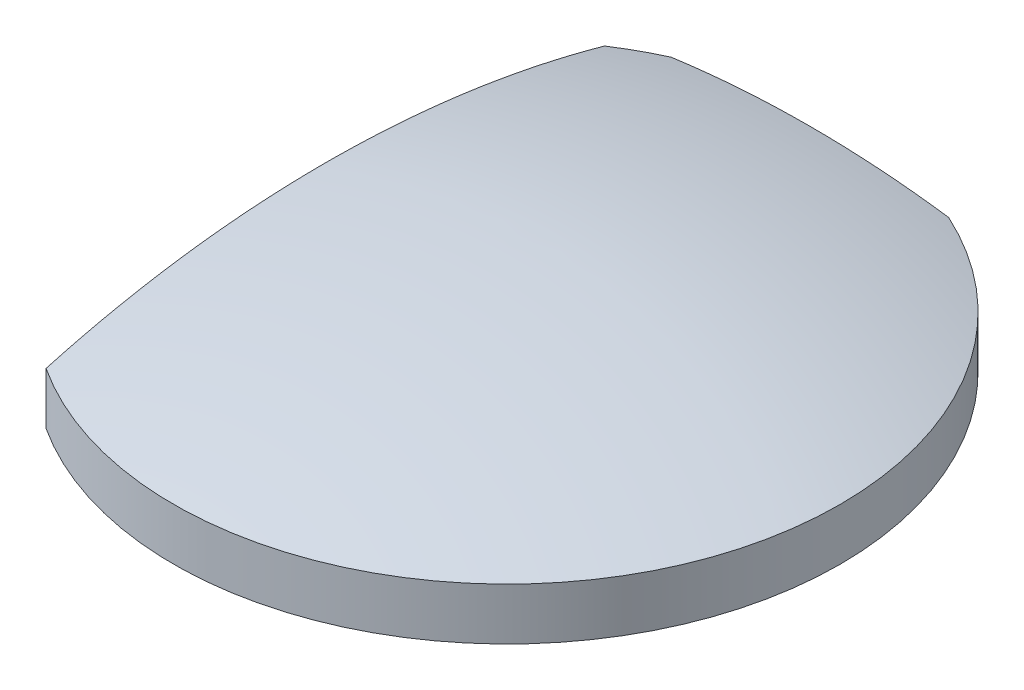
ISO-10303-21;
HEADER;
FILE_DESCRIPTION(('STEP AP214'),'2;1');
FILE_NAME('part.step','',(''),(''),'','','');
FILE_SCHEMA(('AUTOMOTIVE_DESIGN { 1 0 10303 214 1 1 1 1 }'));
ENDSEC;
DATA;
#1=APPLICATION_CONTEXT('core data for automotive mechanical design processes');
#2=APPLICATION_PROTOCOL_DEFINITION('international standard','automotive_design',2000,#1);
#3=PRODUCT_CONTEXT('',#1,'mechanical');
#4=PRODUCT('Part','Part','',(#3));
#5=PRODUCT_RELATED_PRODUCT_CATEGORY('part','',(#4));
#6=PRODUCT_DEFINITION_FORMATION('','',#4);
#7=PRODUCT_DEFINITION_CONTEXT('part definition',#1,'design');
#8=PRODUCT_DEFINITION('design','',#6,#7);
#9=PRODUCT_DEFINITION_SHAPE('','',#8);
#10=(LENGTH_UNIT() NAMED_UNIT(*) SI_UNIT(.MILLI.,.METRE.));
#11=(NAMED_UNIT(*) PLANE_ANGLE_UNIT() SI_UNIT($,.RADIAN.));
#12=(NAMED_UNIT(*) SI_UNIT($,.STERADIAN.) SOLID_ANGLE_UNIT());
#13=UNCERTAINTY_MEASURE_WITH_UNIT(LENGTH_MEASURE(1.E-05),#10,'distance_accuracy_value','');
#14=(GEOMETRIC_REPRESENTATION_CONTEXT(3) GLOBAL_UNCERTAINTY_ASSIGNED_CONTEXT((#13)) GLOBAL_UNIT_ASSIGNED_CONTEXT((#10,
#11,#12)) REPRESENTATION_CONTEXT('',''));
#15=CARTESIAN_POINT('',(0.,0.,0.));
#16=DIRECTION('',(0.,0.,1.));
#17=DIRECTION('',(1.,0.,0.));
#18=AXIS2_PLACEMENT_3D('',#15,#16,#17);
#19=CARTESIAN_POINT('',(0.,-31.25,0.));
#20=DIRECTION('',(0.,1.,0.));
#21=DIRECTION('',(0.,0.,-1.));
#22=AXIS2_PLACEMENT_3D('',#19,#20,#21);
#23=SPHERICAL_SURFACE('',#22,34.75);
#24=CARTESIAN_POINT('',(0.,-31.25,-10.));
#25=DIRECTION('',(0.,0.,-1.));
#26=DIRECTION('',(-1.,0.,0.));
#27=AXIS2_PLACEMENT_3D('',#24,#25,#26);
#28=CIRCLE('',#27,33.2800615985007);
#29=CARTESIAN_POINT('',(-4.58257569495582,1.71304749260906,-10.));
#30=VERTEX_POINT('',#29);
#31=CARTESIAN_POINT('',(4.58257569495583,1.71304749260906,-10.));
#32=VERTEX_POINT('',#31);
#33=EDGE_CURVE('E44',#30,#32,#28,.T.);
#34=ORIENTED_EDGE('',*,*,#33,.F.);
#35=CARTESIAN_POINT('',(0.,1.71304749260906,0.));
#36=DIRECTION('',(0.,1.,0.));
#37=DIRECTION('',(0.,0.,1.));
#38=AXIS2_PLACEMENT_3D('',#35,#36,#37);
#39=CIRCLE('',#38,11.);
#40=CARTESIAN_POINT('',(-6.,1.71304749260906,-9.21954445729288));
#41=VERTEX_POINT('',#40);
#42=EDGE_CURVE('E82',#30,#41,#39,.T.);
#43=ORIENTED_EDGE('',*,*,#42,.T.);
#44=CARTESIAN_POINT('',(-6.,-31.25,0.));
#45=DIRECTION('',(1.,0.,0.));
#46=DIRECTION('',(0.,0.,-1.));
#47=AXIS2_PLACEMENT_3D('',#44,#45,#46);
#48=CIRCLE('',#47,34.2280951850961);
#49=CARTESIAN_POINT('',(-6.,1.71304749260906,9.21954445729288));
#50=VERTEX_POINT('',#49);
#51=EDGE_CURVE('E97',#41,#50,#48,.T.);
#52=ORIENTED_EDGE('',*,*,#51,.T.);
#53=EDGE_CURVE('E85',#50,#32,#39,.T.);
#54=ORIENTED_EDGE('',*,*,#53,.T.);
#55=EDGE_LOOP('',(#34,#43,#52,#54));
#56=FACE_BOUND('',#55,.T.);
#57=ADVANCED_FACE('F31',(#56),#23,.T.);
#58=CARTESIAN_POINT('',(0.,0.,0.));
#59=DIRECTION('',(0.,1.,0.));
#60=DIRECTION('',(0.,0.,1.));
#61=AXIS2_PLACEMENT_3D('',#58,#59,#60);
#62=PLANE('',#61);
#63=DIRECTION('',(1.,0.,0.));
#64=VECTOR('',#63,1.);
#65=CARTESIAN_POINT('',(0.,0.,-10.));
#66=LINE('',#65,#64);
#67=CARTESIAN_POINT('',(-4.58257569495582,0.,-10.));
#68=VERTEX_POINT('',#67);
#69=CARTESIAN_POINT('',(4.58257569495582,0.,-10.));
#70=VERTEX_POINT('',#69);
#71=EDGE_CURVE('E69',#68,#70,#66,.T.);
#72=ORIENTED_EDGE('',*,*,#71,.T.);
#73=CARTESIAN_POINT('',(0.,0.,0.));
#74=DIRECTION('',(0.,1.,0.));
#75=DIRECTION('',(0.,0.,1.));
#76=AXIS2_PLACEMENT_3D('',#73,#74,#75);
#77=CIRCLE('',#76,11.);
#78=CARTESIAN_POINT('',(-6.,0.,9.21954445729288));
#79=VERTEX_POINT('',#78);
#80=EDGE_CURVE('E84',#79,#70,#77,.T.);
#81=ORIENTED_EDGE('',*,*,#80,.F.);
#82=DIRECTION('',(0.,0.,1.));
#83=VECTOR('',#82,1.);
#84=CARTESIAN_POINT('',(-6.,0.,-24.3414213562373));
#85=LINE('',#84,#83);
#86=CARTESIAN_POINT('',(-6.,0.,-9.21954445729288));
#87=VERTEX_POINT('',#86);
#88=EDGE_CURVE('E52',#87,#79,#85,.T.);
#89=ORIENTED_EDGE('',*,*,#88,.F.);
#90=EDGE_CURVE('E81',#68,#87,#77,.T.);
#91=ORIENTED_EDGE('',*,*,#90,.F.);
#92=EDGE_LOOP('',(#72,#81,#89,#91));
#93=FACE_BOUND('',#92,.T.);
#94=ADVANCED_FACE('F83',(#93),#62,.F.);
#95=CARTESIAN_POINT('',(0.,3.5,0.));
#96=DIRECTION('',(0.,1.,0.));
#97=DIRECTION('',(0.,0.,1.));
#98=AXIS2_PLACEMENT_3D('',#95,#96,#97);
#99=CYLINDRICAL_SURFACE('',#98,11.);
#100=DIRECTION('',(0.,1.,0.));
#101=VECTOR('',#100,1.);
#102=CARTESIAN_POINT('',(-4.58257569495583,3.5,-10.));
#103=LINE('',#102,#101);
#104=EDGE_CURVE('E11',#68,#30,#103,.T.);
#105=ORIENTED_EDGE('',*,*,#104,.F.);
#106=ORIENTED_EDGE('',*,*,#90,.T.);
#107=DIRECTION('',(0.,1.,0.));
#108=VECTOR('',#107,1.);
#109=CARTESIAN_POINT('',(-6.,3.5,-9.21954445729288));
#110=LINE('',#109,#108);
#111=EDGE_CURVE('E93',#87,#41,#110,.T.);
#112=ORIENTED_EDGE('',*,*,#111,.T.);
#113=ORIENTED_EDGE('',*,*,#42,.F.);
#114=EDGE_LOOP('',(#105,#106,#112,#113));
#115=FACE_BOUND('',#114,.T.);
#116=ADVANCED_FACE('F79',(#115),#99,.T.);
#117=DIRECTION('',(0.,1.,0.));
#118=VECTOR('',#117,1.);
#119=CARTESIAN_POINT('',(4.58257569495583,3.5,-10.));
#120=LINE('',#119,#118);
#121=EDGE_CURVE('E38',#32,#70,#120,.F.);
#122=ORIENTED_EDGE('',*,*,#121,.F.);
#123=ORIENTED_EDGE('',*,*,#53,.F.);
#124=DIRECTION('',(0.,1.,0.));
#125=VECTOR('',#124,1.);
#126=CARTESIAN_POINT('',(-6.,3.5,9.21954445729288));
#127=LINE('',#126,#125);
#128=EDGE_CURVE('E87',#50,#79,#127,.F.);
#129=ORIENTED_EDGE('',*,*,#128,.T.);
#130=ORIENTED_EDGE('',*,*,#80,.T.);
#131=EDGE_LOOP('',(#122,#123,#129,#130));
#132=FACE_BOUND('',#131,.T.);
#133=ADVANCED_FACE('F103',(#132),#99,.T.);
#134=CARTESIAN_POINT('',(-6.,3.5,-24.3414213562373));
#135=DIRECTION('',(1.,0.,0.));
#136=DIRECTION('',(0.,0.,-1.));
#137=AXIS2_PLACEMENT_3D('',#134,#135,#136);
#138=PLANE('',#137);
#139=ORIENTED_EDGE('',*,*,#111,.F.);
#140=ORIENTED_EDGE('',*,*,#88,.T.);
#141=ORIENTED_EDGE('',*,*,#128,.F.);
#142=ORIENTED_EDGE('',*,*,#51,.F.);
#143=EDGE_LOOP('',(#139,#140,#141,#142));
#144=FACE_BOUND('',#143,.T.);
#145=ADVANCED_FACE('F95',(#144),#138,.F.);
#146=CARTESIAN_POINT('',(0.,3.5,-10.));
#147=DIRECTION('',(0.,0.,-1.));
#148=DIRECTION('',(-1.,0.,0.));
#149=AXIS2_PLACEMENT_3D('',#146,#147,#148);
#150=PLANE('',#149);
#151=ORIENTED_EDGE('',*,*,#33,.T.);
#152=ORIENTED_EDGE('',*,*,#121,.T.);
#153=ORIENTED_EDGE('',*,*,#71,.F.);
#154=ORIENTED_EDGE('',*,*,#104,.T.);
#155=EDGE_LOOP('',(#151,#152,#153,#154));
#156=FACE_BOUND('',#155,.T.);
#157=ADVANCED_FACE('F71',(#156),#150,.T.);
#158=CLOSED_SHELL('',(#57,#94,#116,#133,#145,#157));
#159=MANIFOLD_SOLID_BREP('B2',#158);
#160=ADVANCED_BREP_SHAPE_REPRESENTATION('',(#18,#159),#14);
#161=SHAPE_DEFINITION_REPRESENTATION(#9,#160);
ENDSEC;
END-ISO-10303-21;
